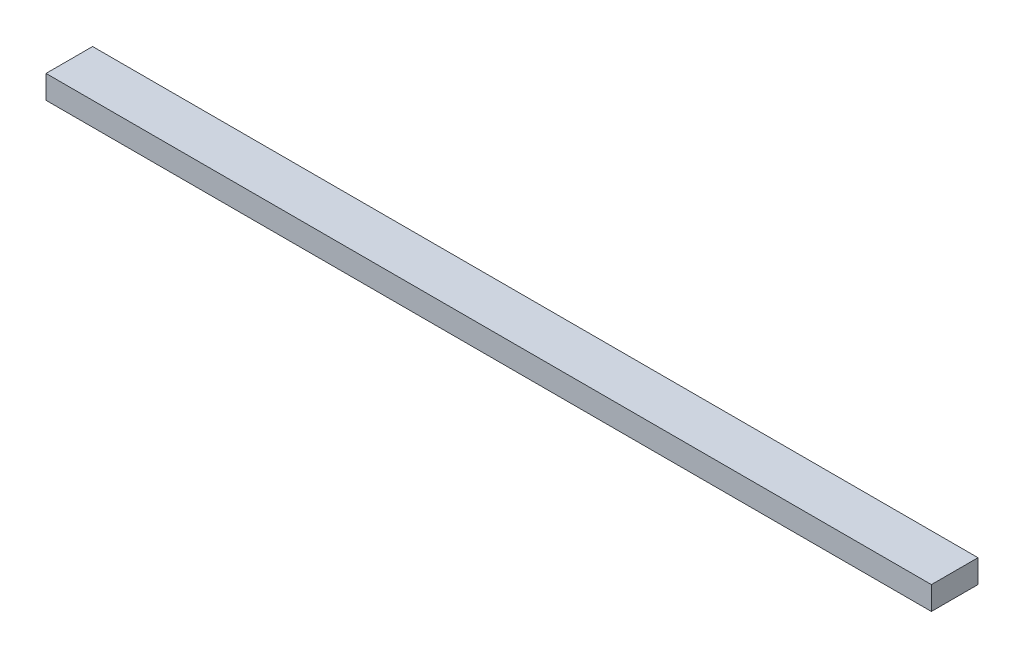
ISO-10303-21;
HEADER;
FILE_DESCRIPTION(('STEP AP214'),'2;1');
FILE_NAME('part.step','',(''),(''),'','','');
FILE_SCHEMA(('AUTOMOTIVE_DESIGN { 1 0 10303 214 1 1 1 1 }'));
ENDSEC;
DATA;
#1=APPLICATION_CONTEXT('core data for automotive mechanical design processes');
#2=APPLICATION_PROTOCOL_DEFINITION('international standard','automotive_design',2000,#1);
#3=PRODUCT_CONTEXT('',#1,'mechanical');
#4=PRODUCT('Part','Part','',(#3));
#5=PRODUCT_RELATED_PRODUCT_CATEGORY('part','',(#4));
#6=PRODUCT_DEFINITION_FORMATION('','',#4);
#7=PRODUCT_DEFINITION_CONTEXT('part definition',#1,'design');
#8=PRODUCT_DEFINITION('design','',#6,#7);
#9=PRODUCT_DEFINITION_SHAPE('','',#8);
#10=(LENGTH_UNIT() NAMED_UNIT(*) SI_UNIT(.MILLI.,.METRE.));
#11=(NAMED_UNIT(*) PLANE_ANGLE_UNIT() SI_UNIT($,.RADIAN.));
#12=(NAMED_UNIT(*) SI_UNIT($,.STERADIAN.) SOLID_ANGLE_UNIT());
#13=UNCERTAINTY_MEASURE_WITH_UNIT(LENGTH_MEASURE(1.E-05),#10,'distance_accuracy_value','');
#14=(GEOMETRIC_REPRESENTATION_CONTEXT(3) GLOBAL_UNCERTAINTY_ASSIGNED_CONTEXT((#13)) GLOBAL_UNIT_ASSIGNED_CONTEXT((#10,
#11,#12)) REPRESENTATION_CONTEXT('',''));
#15=CARTESIAN_POINT('',(0.,0.,0.));
#16=DIRECTION('',(0.,0.,1.));
#17=DIRECTION('',(1.,0.,0.));
#18=AXIS2_PLACEMENT_3D('',#15,#16,#17);
#19=CARTESIAN_POINT('',(0.,3.175,0.));
#20=DIRECTION('',(-1.,0.,0.));
#21=DIRECTION('',(0.,0.,1.));
#22=AXIS2_PLACEMENT_3D('',#19,#20,#21);
#23=PLANE('',#22);
#24=DIRECTION('',(0.,0.,-1.));
#25=VECTOR('',#24,1.);
#26=CARTESIAN_POINT('',(0.,0.,0.));
#27=LINE('',#26,#25);
#28=CARTESIAN_POINT('',(0.,0.,0.));
#29=VERTEX_POINT('',#28);
#30=CARTESIAN_POINT('',(0.,0.,-6.35));
#31=VERTEX_POINT('',#30);
#32=EDGE_CURVE('E95',#29,#31,#27,.T.);
#33=ORIENTED_EDGE('',*,*,#32,.T.);
#34=DIRECTION('',(0.,-1.,0.));
#35=VECTOR('',#34,1.);
#36=CARTESIAN_POINT('',(0.,3.175,-6.35));
#37=LINE('',#36,#35);
#38=CARTESIAN_POINT('',(0.,3.175,-6.35));
#39=VERTEX_POINT('',#38);
#40=EDGE_CURVE('E11',#39,#31,#37,.T.);
#41=ORIENTED_EDGE('',*,*,#40,.F.);
#42=DIRECTION('',(0.,0.,-1.));
#43=VECTOR('',#42,1.);
#44=CARTESIAN_POINT('',(0.,3.175,0.));
#45=LINE('',#44,#43);
#46=CARTESIAN_POINT('',(0.,3.175,0.));
#47=VERTEX_POINT('',#46);
#48=EDGE_CURVE('E83',#47,#39,#45,.T.);
#49=ORIENTED_EDGE('',*,*,#48,.F.);
#50=DIRECTION('',(0.,-1.,0.));
#51=VECTOR('',#50,1.);
#52=CARTESIAN_POINT('',(0.,3.175,0.));
#53=LINE('',#52,#51);
#54=EDGE_CURVE('E91',#47,#29,#53,.T.);
#55=ORIENTED_EDGE('',*,*,#54,.T.);
#56=EDGE_LOOP('',(#33,#41,#49,#55));
#57=FACE_BOUND('',#56,.T.);
#58=ADVANCED_FACE('F32',(#57),#23,.F.);
#59=CARTESIAN_POINT('',(0.,3.175,-6.35));
#60=DIRECTION('',(0.,0.,1.));
#61=DIRECTION('',(1.,0.,0.));
#62=AXIS2_PLACEMENT_3D('',#59,#60,#61);
#63=PLANE('',#62);
#64=DIRECTION('',(-1.,0.,0.));
#65=VECTOR('',#64,1.);
#66=CARTESIAN_POINT('',(0.,0.,-6.35));
#67=LINE('',#66,#65);
#68=CARTESIAN_POINT('',(-120.65,0.,-6.34999999999999));
#69=VERTEX_POINT('',#68);
#70=EDGE_CURVE('E87',#31,#69,#67,.T.);
#71=ORIENTED_EDGE('',*,*,#70,.T.);
#72=DIRECTION('',(0.,-1.,0.));
#73=VECTOR('',#72,1.);
#74=CARTESIAN_POINT('',(-120.65,3.175,-6.34999999999999));
#75=LINE('',#74,#73);
#76=CARTESIAN_POINT('',(-120.65,3.175,-6.34999999999999));
#77=VERTEX_POINT('',#76);
#78=EDGE_CURVE('E40',#77,#69,#75,.T.);
#79=ORIENTED_EDGE('',*,*,#78,.F.);
#80=DIRECTION('',(-1.,0.,0.));
#81=VECTOR('',#80,1.);
#82=CARTESIAN_POINT('',(0.,3.175,-6.35));
#83=LINE('',#82,#81);
#84=EDGE_CURVE('E78',#39,#77,#83,.T.);
#85=ORIENTED_EDGE('',*,*,#84,.F.);
#86=ORIENTED_EDGE('',*,*,#40,.T.);
#87=EDGE_LOOP('',(#71,#79,#85,#86));
#88=FACE_BOUND('',#87,.T.);
#89=ADVANCED_FACE('F86',(#88),#63,.F.);
#90=CARTESIAN_POINT('',(-120.65,3.175,0.));
#91=DIRECTION('',(1.,0.,0.));
#92=DIRECTION('',(0.,0.,-1.));
#93=AXIS2_PLACEMENT_3D('',#90,#91,#92);
#94=PLANE('',#93);
#95=DIRECTION('',(0.,0.,1.));
#96=VECTOR('',#95,1.);
#97=CARTESIAN_POINT('',(-120.65,0.,0.));
#98=LINE('',#97,#96);
#99=CARTESIAN_POINT('',(-120.65,0.,0.));
#100=VERTEX_POINT('',#99);
#101=EDGE_CURVE('E65',#69,#100,#98,.T.);
#102=ORIENTED_EDGE('',*,*,#101,.T.);
#103=DIRECTION('',(0.,-1.,0.));
#104=VECTOR('',#103,1.);
#105=CARTESIAN_POINT('',(-120.65,3.175,0.));
#106=LINE('',#105,#104);
#107=CARTESIAN_POINT('',(-120.65,3.175,0.));
#108=VERTEX_POINT('',#107);
#109=EDGE_CURVE('E88',#108,#100,#106,.T.);
#110=ORIENTED_EDGE('',*,*,#109,.F.);
#111=DIRECTION('',(0.,0.,1.));
#112=VECTOR('',#111,1.);
#113=CARTESIAN_POINT('',(-120.65,3.175,0.));
#114=LINE('',#113,#112);
#115=EDGE_CURVE('E81',#77,#108,#114,.T.);
#116=ORIENTED_EDGE('',*,*,#115,.F.);
#117=ORIENTED_EDGE('',*,*,#78,.T.);
#118=EDGE_LOOP('',(#102,#110,#116,#117));
#119=FACE_BOUND('',#118,.T.);
#120=ADVANCED_FACE('F89',(#119),#94,.F.);
#121=CARTESIAN_POINT('',(0.,3.175,0.));
#122=DIRECTION('',(0.,0.,-1.));
#123=DIRECTION('',(-1.,0.,0.));
#124=AXIS2_PLACEMENT_3D('',#121,#122,#123);
#125=PLANE('',#124);
#126=DIRECTION('',(1.,0.,0.));
#127=VECTOR('',#126,1.);
#128=CARTESIAN_POINT('',(0.,0.,0.));
#129=LINE('',#128,#127);
#130=EDGE_CURVE('E71',#100,#29,#129,.T.);
#131=ORIENTED_EDGE('',*,*,#130,.T.);
#132=ORIENTED_EDGE('',*,*,#54,.F.);
#133=DIRECTION('',(1.,0.,0.));
#134=VECTOR('',#133,1.);
#135=CARTESIAN_POINT('',(0.,3.175,0.));
#136=LINE('',#135,#134);
#137=EDGE_CURVE('E48',#108,#47,#136,.T.);
#138=ORIENTED_EDGE('',*,*,#137,.F.);
#139=ORIENTED_EDGE('',*,*,#109,.T.);
#140=EDGE_LOOP('',(#131,#132,#138,#139));
#141=FACE_BOUND('',#140,.T.);
#142=ADVANCED_FACE('F102',(#141),#125,.F.);
#143=CARTESIAN_POINT('',(0.,3.175,0.));
#144=DIRECTION('',(0.,1.,0.));
#145=DIRECTION('',(0.,0.,1.));
#146=AXIS2_PLACEMENT_3D('',#143,#144,#145);
#147=PLANE('',#146);
#148=ORIENTED_EDGE('',*,*,#48,.T.);
#149=ORIENTED_EDGE('',*,*,#84,.T.);
#150=ORIENTED_EDGE('',*,*,#115,.T.);
#151=ORIENTED_EDGE('',*,*,#137,.T.);
#152=EDGE_LOOP('',(#148,#149,#150,#151));
#153=FACE_BOUND('',#152,.T.);
#154=ADVANCED_FACE('F79',(#153),#147,.T.);
#155=CARTESIAN_POINT('',(0.,0.,0.));
#156=DIRECTION('',(0.,1.,0.));
#157=DIRECTION('',(0.,0.,1.));
#158=AXIS2_PLACEMENT_3D('',#155,#156,#157);
#159=PLANE('',#158);
#160=ORIENTED_EDGE('',*,*,#32,.F.);
#161=ORIENTED_EDGE('',*,*,#130,.F.);
#162=ORIENTED_EDGE('',*,*,#101,.F.);
#163=ORIENTED_EDGE('',*,*,#70,.F.);
#164=EDGE_LOOP('',(#160,#161,#162,#163));
#165=FACE_BOUND('',#164,.T.);
#166=ADVANCED_FACE('F105',(#165),#159,.F.);
#167=CLOSED_SHELL('',(#58,#89,#120,#142,#154,#166));
#168=MANIFOLD_SOLID_BREP('B2',#167);
#169=ADVANCED_BREP_SHAPE_REPRESENTATION('',(#18,#168),#14);
#170=SHAPE_DEFINITION_REPRESENTATION(#9,#169);
ENDSEC;
END-ISO-10303-21;
